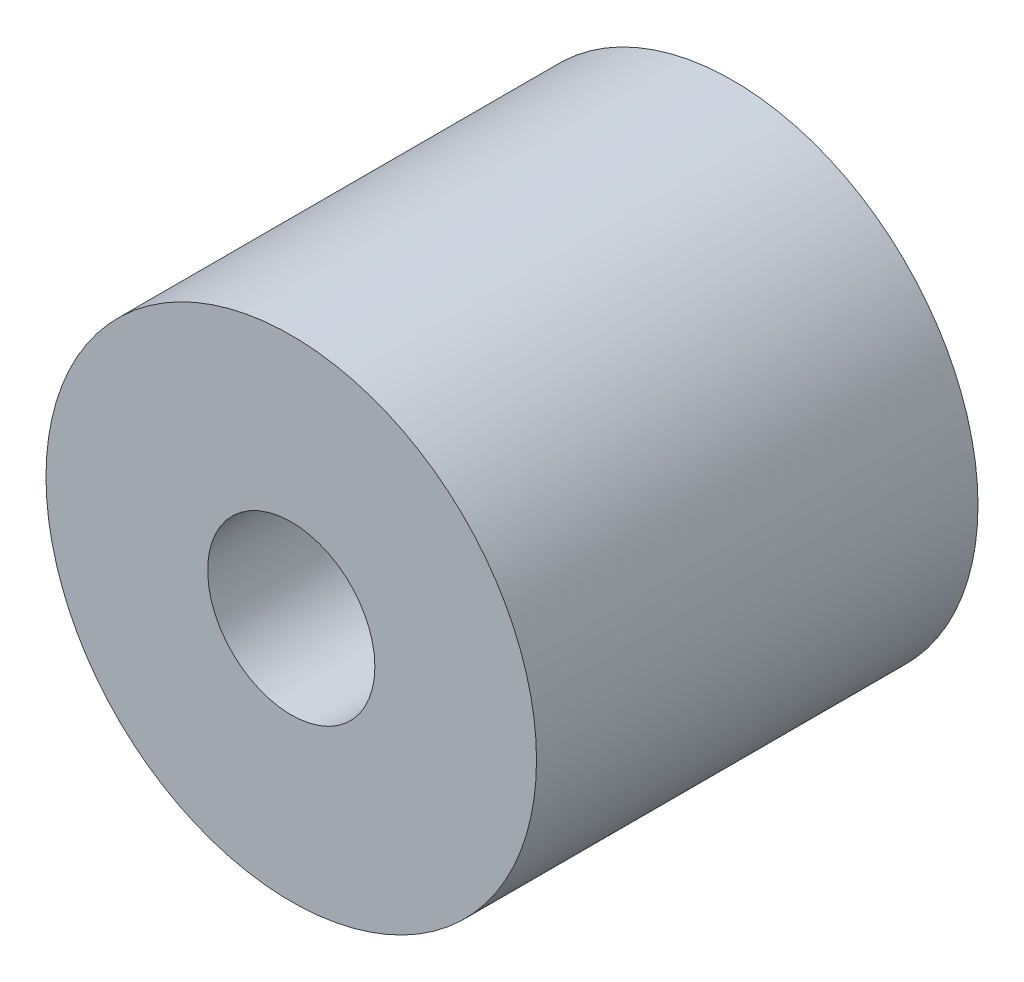
ISO-10303-21;
HEADER;
FILE_DESCRIPTION(('STEP AP214'),'2;1');
FILE_NAME('part.step','',(''),(''),'','','');
FILE_SCHEMA(('AUTOMOTIVE_DESIGN { 1 0 10303 214 1 1 1 1 }'));
ENDSEC;
DATA;
#1=APPLICATION_CONTEXT('core data for automotive mechanical design processes');
#2=APPLICATION_PROTOCOL_DEFINITION('international standard','automotive_design',2000,#1);
#3=PRODUCT_CONTEXT('',#1,'mechanical');
#4=PRODUCT('Part','Part','',(#3));
#5=PRODUCT_RELATED_PRODUCT_CATEGORY('part','',(#4));
#6=PRODUCT_DEFINITION_FORMATION('','',#4);
#7=PRODUCT_DEFINITION_CONTEXT('part definition',#1,'design');
#8=PRODUCT_DEFINITION('design','',#6,#7);
#9=PRODUCT_DEFINITION_SHAPE('','',#8);
#10=(LENGTH_UNIT() NAMED_UNIT(*) SI_UNIT(.MILLI.,.METRE.));
#11=(NAMED_UNIT(*) PLANE_ANGLE_UNIT() SI_UNIT($,.RADIAN.));
#12=(NAMED_UNIT(*) SI_UNIT($,.STERADIAN.) SOLID_ANGLE_UNIT());
#13=UNCERTAINTY_MEASURE_WITH_UNIT(LENGTH_MEASURE(1.E-05),#10,'distance_accuracy_value','');
#14=(GEOMETRIC_REPRESENTATION_CONTEXT(3) GLOBAL_UNCERTAINTY_ASSIGNED_CONTEXT((#13)) GLOBAL_UNIT_ASSIGNED_CONTEXT((#10,
#11,#12)) REPRESENTATION_CONTEXT('',''));
#15=CARTESIAN_POINT('',(0.,0.,0.));
#16=DIRECTION('',(0.,0.,1.));
#17=DIRECTION('',(1.,0.,0.));
#18=AXIS2_PLACEMENT_3D('',#15,#16,#17);
#19=CARTESIAN_POINT('',(0.,0.,9.9));
#20=DIRECTION('',(0.,0.,1.));
#21=DIRECTION('',(1.,0.,0.));
#22=AXIS2_PLACEMENT_3D('',#19,#20,#21);
#23=PLANE('',#22);
#24=CARTESIAN_POINT('',(0.,0.,9.9));
#25=DIRECTION('',(0.,0.,1.));
#26=DIRECTION('',(1.,0.,0.));
#27=AXIS2_PLACEMENT_3D('',#24,#25,#26);
#28=CIRCLE('',#27,5.5);
#29=CARTESIAN_POINT('',(5.5,0.,9.9));
#30=VERTEX_POINT('',#29);
#31=EDGE_CURVE('E10',#30,#30,#28,.T.);
#32=ORIENTED_EDGE('',*,*,#31,.T.);
#33=EDGE_LOOP('',(#32));
#34=FACE_BOUND('',#33,.T.);
#35=CARTESIAN_POINT('',(0.,0.,9.9));
#36=DIRECTION('',(0.,0.,1.));
#37=DIRECTION('',(1.,0.,0.));
#38=AXIS2_PLACEMENT_3D('',#35,#36,#37);
#39=CIRCLE('',#38,1.875);
#40=CARTESIAN_POINT('',(1.875,0.,9.9));
#41=VERTEX_POINT('',#40);
#42=EDGE_CURVE('E43',#41,#41,#39,.T.);
#43=ORIENTED_EDGE('',*,*,#42,.F.);
#44=EDGE_LOOP('',(#43));
#45=FACE_BOUND('',#44,.T.);
#46=ADVANCED_FACE('F32',(#34,#45),#23,.T.);
#47=CARTESIAN_POINT('',(0.,0.,0.));
#48=DIRECTION('',(0.,0.,1.));
#49=DIRECTION('',(1.,0.,0.));
#50=AXIS2_PLACEMENT_3D('',#47,#48,#49);
#51=PLANE('',#50);
#52=CARTESIAN_POINT('',(0.,0.,0.));
#53=DIRECTION('',(0.,0.,1.));
#54=DIRECTION('',(1.,0.,0.));
#55=AXIS2_PLACEMENT_3D('',#52,#53,#54);
#56=CIRCLE('',#55,5.5);
#57=CARTESIAN_POINT('',(5.5,0.,0.));
#58=VERTEX_POINT('',#57);
#59=EDGE_CURVE('E36',#58,#58,#56,.T.);
#60=ORIENTED_EDGE('',*,*,#59,.F.);
#61=EDGE_LOOP('',(#60));
#62=FACE_BOUND('',#61,.T.);
#63=CARTESIAN_POINT('',(0.,0.,0.));
#64=DIRECTION('',(0.,0.,1.));
#65=DIRECTION('',(1.,0.,0.));
#66=AXIS2_PLACEMENT_3D('',#63,#64,#65);
#67=CIRCLE('',#66,1.875);
#68=CARTESIAN_POINT('',(1.875,0.,0.));
#69=VERTEX_POINT('',#68);
#70=EDGE_CURVE('E45',#69,#69,#67,.T.);
#71=ORIENTED_EDGE('',*,*,#70,.T.);
#72=EDGE_LOOP('',(#71));
#73=FACE_BOUND('',#72,.T.);
#74=ADVANCED_FACE('F55',(#62,#73),#51,.F.);
#75=CARTESIAN_POINT('',(0.,0.,9.9));
#76=DIRECTION('',(0.,0.,-1.));
#77=DIRECTION('',(-1.,0.,0.));
#78=AXIS2_PLACEMENT_3D('',#75,#76,#77);
#79=CYLINDRICAL_SURFACE('',#78,5.5);
#80=ORIENTED_EDGE('',*,*,#31,.F.);
#81=EDGE_LOOP('',(#80));
#82=FACE_BOUND('',#81,.T.);
#83=ORIENTED_EDGE('',*,*,#59,.T.);
#84=EDGE_LOOP('',(#83));
#85=FACE_BOUND('',#84,.T.);
#86=ADVANCED_FACE('F34',(#82,#85),#79,.T.);
#87=CARTESIAN_POINT('',(0.,0.,9.9));
#88=DIRECTION('',(0.,0.,-1.));
#89=DIRECTION('',(-1.,0.,0.));
#90=AXIS2_PLACEMENT_3D('',#87,#88,#89);
#91=CYLINDRICAL_SURFACE('',#90,1.875);
#92=ORIENTED_EDGE('',*,*,#42,.T.);
#93=EDGE_LOOP('',(#92));
#94=FACE_BOUND('',#93,.T.);
#95=ORIENTED_EDGE('',*,*,#70,.F.);
#96=EDGE_LOOP('',(#95));
#97=FACE_BOUND('',#96,.T.);
#98=ADVANCED_FACE('F51',(#94,#97),#91,.F.);
#99=CLOSED_SHELL('',(#46,#74,#86,#98));
#100=MANIFOLD_SOLID_BREP('B2',#99);
#101=ADVANCED_BREP_SHAPE_REPRESENTATION('',(#18,#100),#14);
#102=SHAPE_DEFINITION_REPRESENTATION(#9,#101);
ENDSEC;
END-ISO-10303-21;
